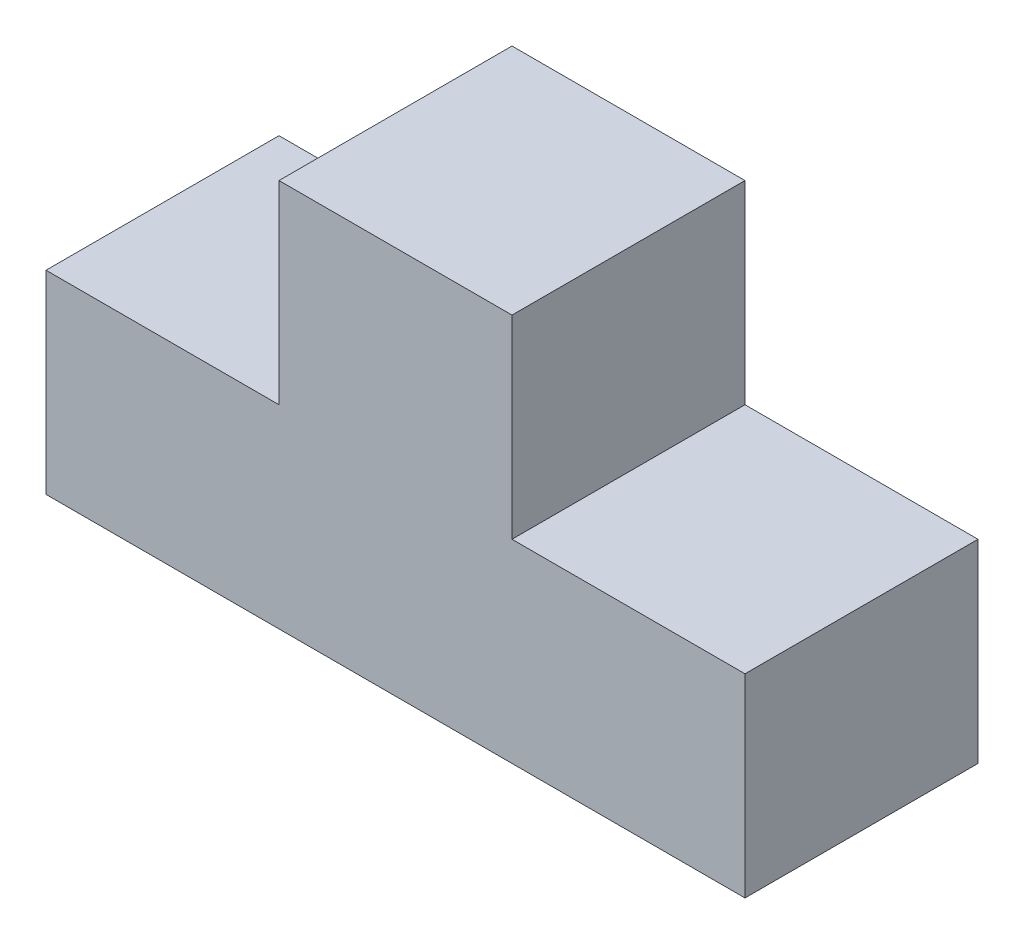
ISO-10303-21;
HEADER;
FILE_DESCRIPTION(('STEP AP214'),'2;1');
FILE_NAME('part.step','',(''),(''),'','','');
FILE_SCHEMA(('AUTOMOTIVE_DESIGN { 1 0 10303 214 1 1 1 1 }'));
ENDSEC;
DATA;
#1=APPLICATION_CONTEXT('core data for automotive mechanical design processes');
#2=APPLICATION_PROTOCOL_DEFINITION('international standard','automotive_design',2000,#1);
#3=PRODUCT_CONTEXT('',#1,'mechanical');
#4=PRODUCT('Part','Part','',(#3));
#5=PRODUCT_RELATED_PRODUCT_CATEGORY('part','',(#4));
#6=PRODUCT_DEFINITION_FORMATION('','',#4);
#7=PRODUCT_DEFINITION_CONTEXT('part definition',#1,'design');
#8=PRODUCT_DEFINITION('design','',#6,#7);
#9=PRODUCT_DEFINITION_SHAPE('','',#8);
#10=(LENGTH_UNIT() NAMED_UNIT(*) SI_UNIT(.MILLI.,.METRE.));
#11=(NAMED_UNIT(*) PLANE_ANGLE_UNIT() SI_UNIT($,.RADIAN.));
#12=(NAMED_UNIT(*) SI_UNIT($,.STERADIAN.) SOLID_ANGLE_UNIT());
#13=UNCERTAINTY_MEASURE_WITH_UNIT(LENGTH_MEASURE(1.E-05),#10,'distance_accuracy_value','');
#14=(GEOMETRIC_REPRESENTATION_CONTEXT(3) GLOBAL_UNCERTAINTY_ASSIGNED_CONTEXT((#13)) GLOBAL_UNIT_ASSIGNED_CONTEXT((#10,
#11,#12)) REPRESENTATION_CONTEXT('',''));
#15=CARTESIAN_POINT('',(0.,0.,0.));
#16=DIRECTION('',(0.,0.,1.));
#17=DIRECTION('',(1.,0.,0.));
#18=AXIS2_PLACEMENT_3D('',#15,#16,#17);
#19=CARTESIAN_POINT('',(45.,25.,30.));
#20=DIRECTION('',(0.,-1.,0.));
#21=DIRECTION('',(1.,0.,0.));
#22=AXIS2_PLACEMENT_3D('',#19,#20,#21);
#23=PLANE('',#22);
#24=DIRECTION('',(-1.,0.,0.));
#25=VECTOR('',#24,1.);
#26=CARTESIAN_POINT('',(45.,25.,0.));
#27=LINE('',#26,#25);
#28=CARTESIAN_POINT('',(45.,25.,0.));
#29=VERTEX_POINT('',#28);
#30=CARTESIAN_POINT('',(15.,25.,0.));
#31=VERTEX_POINT('',#30);
#32=EDGE_CURVE('E131',#29,#31,#27,.T.);
#33=ORIENTED_EDGE('',*,*,#32,.T.);
#34=DIRECTION('',(0.,0.,-1.));
#35=VECTOR('',#34,1.);
#36=CARTESIAN_POINT('',(15.,25.,30.));
#37=LINE('',#36,#35);
#38=CARTESIAN_POINT('',(15.,25.,30.));
#39=VERTEX_POINT('',#38);
#40=EDGE_CURVE('E11',#39,#31,#37,.T.);
#41=ORIENTED_EDGE('',*,*,#40,.F.);
#42=DIRECTION('',(-1.,0.,0.));
#43=VECTOR('',#42,1.);
#44=CARTESIAN_POINT('',(45.,25.,30.));
#45=LINE('',#44,#43);
#46=CARTESIAN_POINT('',(45.,25.,30.));
#47=VERTEX_POINT('',#46);
#48=EDGE_CURVE('E148',#47,#39,#45,.T.);
#49=ORIENTED_EDGE('',*,*,#48,.F.);
#50=DIRECTION('',(0.,0.,-1.));
#51=VECTOR('',#50,1.);
#52=CARTESIAN_POINT('',(45.,25.,30.));
#53=LINE('',#52,#51);
#54=EDGE_CURVE('E130',#47,#29,#53,.T.);
#55=ORIENTED_EDGE('',*,*,#54,.T.);
#56=EDGE_LOOP('',(#33,#41,#49,#55));
#57=FACE_BOUND('',#56,.T.);
#58=ADVANCED_FACE('F33',(#57),#23,.F.);
#59=CARTESIAN_POINT('',(15.,25.,30.));
#60=DIRECTION('',(-1.,0.,0.));
#61=DIRECTION('',(0.,0.,1.));
#62=AXIS2_PLACEMENT_3D('',#59,#60,#61);
#63=PLANE('',#62);
#64=DIRECTION('',(0.,1.,0.));
#65=VECTOR('',#64,1.);
#66=CARTESIAN_POINT('',(15.,25.,0.));
#67=LINE('',#66,#65);
#68=CARTESIAN_POINT('',(15.,50.,0.));
#69=VERTEX_POINT('',#68);
#70=EDGE_CURVE('E134',#31,#69,#67,.T.);
#71=ORIENTED_EDGE('',*,*,#70,.T.);
#72=DIRECTION('',(0.,0.,-1.));
#73=VECTOR('',#72,1.);
#74=CARTESIAN_POINT('',(15.,50.,30.));
#75=LINE('',#74,#73);
#76=CARTESIAN_POINT('',(15.,50.,30.));
#77=VERTEX_POINT('',#76);
#78=EDGE_CURVE('E41',#77,#69,#75,.T.);
#79=ORIENTED_EDGE('',*,*,#78,.F.);
#80=DIRECTION('',(0.,1.,0.));
#81=VECTOR('',#80,1.);
#82=CARTESIAN_POINT('',(15.,25.,30.));
#83=LINE('',#82,#81);
#84=EDGE_CURVE('E91',#39,#77,#83,.T.);
#85=ORIENTED_EDGE('',*,*,#84,.F.);
#86=ORIENTED_EDGE('',*,*,#40,.T.);
#87=EDGE_LOOP('',(#71,#79,#85,#86));
#88=FACE_BOUND('',#87,.T.);
#89=ADVANCED_FACE('F176',(#88),#63,.F.);
#90=CARTESIAN_POINT('',(15.,50.,30.));
#91=DIRECTION('',(0.,-1.,0.));
#92=DIRECTION('',(0.,0.,-1.));
#93=AXIS2_PLACEMENT_3D('',#90,#91,#92);
#94=PLANE('',#93);
#95=DIRECTION('',(-1.,0.,0.));
#96=VECTOR('',#95,1.);
#97=CARTESIAN_POINT('',(15.,50.,0.));
#98=LINE('',#97,#96);
#99=CARTESIAN_POINT('',(-15.,50.,0.));
#100=VERTEX_POINT('',#99);
#101=EDGE_CURVE('E136',#69,#100,#98,.T.);
#102=ORIENTED_EDGE('',*,*,#101,.T.);
#103=DIRECTION('',(0.,0.,-1.));
#104=VECTOR('',#103,1.);
#105=CARTESIAN_POINT('',(-15.,50.,30.));
#106=LINE('',#105,#104);
#107=CARTESIAN_POINT('',(-15.,50.,30.));
#108=VERTEX_POINT('',#107);
#109=EDGE_CURVE('E154',#108,#100,#106,.T.);
#110=ORIENTED_EDGE('',*,*,#109,.F.);
#111=DIRECTION('',(-1.,0.,0.));
#112=VECTOR('',#111,1.);
#113=CARTESIAN_POINT('',(15.,50.,30.));
#114=LINE('',#113,#112);
#115=EDGE_CURVE('E161',#77,#108,#114,.T.);
#116=ORIENTED_EDGE('',*,*,#115,.F.);
#117=ORIENTED_EDGE('',*,*,#78,.T.);
#118=EDGE_LOOP('',(#102,#110,#116,#117));
#119=FACE_BOUND('',#118,.T.);
#120=ADVANCED_FACE('F159',(#119),#94,.F.);
#121=CARTESIAN_POINT('',(-15.,25.,30.));
#122=DIRECTION('',(-1.,0.,0.));
#123=DIRECTION('',(0.,0.,1.));
#124=AXIS2_PLACEMENT_3D('',#121,#122,#123);
#125=PLANE('',#124);
#126=DIRECTION('',(0.,1.,0.));
#127=VECTOR('',#126,1.);
#128=CARTESIAN_POINT('',(-15.,25.,0.));
#129=LINE('',#128,#127);
#130=CARTESIAN_POINT('',(-15.,25.,0.));
#131=VERTEX_POINT('',#130);
#132=EDGE_CURVE('E139',#131,#100,#129,.T.);
#133=ORIENTED_EDGE('',*,*,#132,.F.);
#134=DIRECTION('',(0.,0.,-1.));
#135=VECTOR('',#134,1.);
#136=CARTESIAN_POINT('',(-15.,25.,30.));
#137=LINE('',#136,#135);
#138=CARTESIAN_POINT('',(-15.,25.,30.));
#139=VERTEX_POINT('',#138);
#140=EDGE_CURVE('E152',#139,#131,#137,.T.);
#141=ORIENTED_EDGE('',*,*,#140,.F.);
#142=DIRECTION('',(0.,1.,0.));
#143=VECTOR('',#142,1.);
#144=CARTESIAN_POINT('',(-15.,25.,30.));
#145=LINE('',#144,#143);
#146=EDGE_CURVE('E125',#139,#108,#145,.T.);
#147=ORIENTED_EDGE('',*,*,#146,.T.);
#148=ORIENTED_EDGE('',*,*,#109,.T.);
#149=EDGE_LOOP('',(#133,#141,#147,#148));
#150=FACE_BOUND('',#149,.T.);
#151=ADVANCED_FACE('F168',(#150),#125,.T.);
#152=CARTESIAN_POINT('',(-45.,25.,30.));
#153=DIRECTION('',(0.,1.,0.));
#154=DIRECTION('',(-1.,0.,0.));
#155=AXIS2_PLACEMENT_3D('',#152,#153,#154);
#156=PLANE('',#155);
#157=DIRECTION('',(1.,0.,0.));
#158=VECTOR('',#157,1.);
#159=CARTESIAN_POINT('',(-45.,25.,0.));
#160=LINE('',#159,#158);
#161=CARTESIAN_POINT('',(-45.,25.,0.));
#162=VERTEX_POINT('',#161);
#163=EDGE_CURVE('E142',#162,#131,#160,.T.);
#164=ORIENTED_EDGE('',*,*,#163,.F.);
#165=DIRECTION('',(0.,0.,-1.));
#166=VECTOR('',#165,1.);
#167=CARTESIAN_POINT('',(-45.,25.,30.));
#168=LINE('',#167,#166);
#169=CARTESIAN_POINT('',(-45.,25.,30.));
#170=VERTEX_POINT('',#169);
#171=EDGE_CURVE('E113',#170,#162,#168,.T.);
#172=ORIENTED_EDGE('',*,*,#171,.F.);
#173=DIRECTION('',(1.,0.,0.));
#174=VECTOR('',#173,1.);
#175=CARTESIAN_POINT('',(-45.,25.,30.));
#176=LINE('',#175,#174);
#177=EDGE_CURVE('E123',#170,#139,#176,.T.);
#178=ORIENTED_EDGE('',*,*,#177,.T.);
#179=ORIENTED_EDGE('',*,*,#140,.T.);
#180=EDGE_LOOP('',(#164,#172,#178,#179));
#181=FACE_BOUND('',#180,.T.);
#182=ADVANCED_FACE('F186',(#181),#156,.T.);
#183=CARTESIAN_POINT('',(-45.,0.,30.));
#184=DIRECTION('',(-1.,0.,0.));
#185=DIRECTION('',(0.,0.,1.));
#186=AXIS2_PLACEMENT_3D('',#183,#184,#185);
#187=PLANE('',#186);
#188=DIRECTION('',(0.,1.,0.));
#189=VECTOR('',#188,1.);
#190=CARTESIAN_POINT('',(-45.,0.,0.));
#191=LINE('',#190,#189);
#192=CARTESIAN_POINT('',(-45.,0.,0.));
#193=VERTEX_POINT('',#192);
#194=EDGE_CURVE('E112',#193,#162,#191,.T.);
#195=ORIENTED_EDGE('',*,*,#194,.F.);
#196=DIRECTION('',(0.,0.,-1.));
#197=VECTOR('',#196,1.);
#198=CARTESIAN_POINT('',(-45.,0.,30.));
#199=LINE('',#198,#197);
#200=CARTESIAN_POINT('',(-45.,0.,30.));
#201=VERTEX_POINT('',#200);
#202=EDGE_CURVE('E106',#201,#193,#199,.T.);
#203=ORIENTED_EDGE('',*,*,#202,.F.);
#204=DIRECTION('',(0.,1.,0.));
#205=VECTOR('',#204,1.);
#206=CARTESIAN_POINT('',(-45.,0.,30.));
#207=LINE('',#206,#205);
#208=EDGE_CURVE('E110',#201,#170,#207,.T.);
#209=ORIENTED_EDGE('',*,*,#208,.T.);
#210=ORIENTED_EDGE('',*,*,#171,.T.);
#211=EDGE_LOOP('',(#195,#203,#209,#210));
#212=FACE_BOUND('',#211,.T.);
#213=ADVANCED_FACE('F108',(#212),#187,.T.);
#214=CARTESIAN_POINT('',(-45.,0.,30.));
#215=DIRECTION('',(0.,1.,0.));
#216=DIRECTION('',(0.,0.,1.));
#217=AXIS2_PLACEMENT_3D('',#214,#215,#216);
#218=PLANE('',#217);
#219=DIRECTION('',(1.,0.,0.));
#220=VECTOR('',#219,1.);
#221=CARTESIAN_POINT('',(-45.,0.,0.));
#222=LINE('',#221,#220);
#223=CARTESIAN_POINT('',(45.,0.,0.));
#224=VERTEX_POINT('',#223);
#225=EDGE_CURVE('E77',#193,#224,#222,.T.);
#226=ORIENTED_EDGE('',*,*,#225,.T.);
#227=DIRECTION('',(0.,0.,-1.));
#228=VECTOR('',#227,1.);
#229=CARTESIAN_POINT('',(45.,0.,30.));
#230=LINE('',#229,#228);
#231=CARTESIAN_POINT('',(45.,0.,30.));
#232=VERTEX_POINT('',#231);
#233=EDGE_CURVE('E114',#232,#224,#230,.T.);
#234=ORIENTED_EDGE('',*,*,#233,.F.);
#235=DIRECTION('',(1.,0.,0.));
#236=VECTOR('',#235,1.);
#237=CARTESIAN_POINT('',(-45.,0.,30.));
#238=LINE('',#237,#236);
#239=EDGE_CURVE('E116',#201,#232,#238,.T.);
#240=ORIENTED_EDGE('',*,*,#239,.F.);
#241=ORIENTED_EDGE('',*,*,#202,.T.);
#242=EDGE_LOOP('',(#226,#234,#240,#241));
#243=FACE_BOUND('',#242,.T.);
#244=ADVANCED_FACE('F117',(#243),#218,.F.);
#245=CARTESIAN_POINT('',(45.,0.,30.));
#246=DIRECTION('',(-1.,0.,0.));
#247=DIRECTION('',(0.,0.,1.));
#248=AXIS2_PLACEMENT_3D('',#245,#246,#247);
#249=PLANE('',#248);
#250=DIRECTION('',(0.,1.,0.));
#251=VECTOR('',#250,1.);
#252=CARTESIAN_POINT('',(45.,0.,0.));
#253=LINE('',#252,#251);
#254=EDGE_CURVE('E83',#224,#29,#253,.T.);
#255=ORIENTED_EDGE('',*,*,#254,.T.);
#256=ORIENTED_EDGE('',*,*,#54,.F.);
#257=DIRECTION('',(0.,1.,0.));
#258=VECTOR('',#257,1.);
#259=CARTESIAN_POINT('',(45.,0.,30.));
#260=LINE('',#259,#258);
#261=EDGE_CURVE('E49',#232,#47,#260,.T.);
#262=ORIENTED_EDGE('',*,*,#261,.F.);
#263=ORIENTED_EDGE('',*,*,#233,.T.);
#264=EDGE_LOOP('',(#255,#256,#262,#263));
#265=FACE_BOUND('',#264,.T.);
#266=ADVANCED_FACE('F194',(#265),#249,.F.);
#267=CARTESIAN_POINT('',(0.,0.,30.));
#268=DIRECTION('',(0.,0.,-1.));
#269=DIRECTION('',(-1.,0.,0.));
#270=AXIS2_PLACEMENT_3D('',#267,#268,#269);
#271=PLANE('',#270);
#272=ORIENTED_EDGE('',*,*,#48,.T.);
#273=ORIENTED_EDGE('',*,*,#84,.T.);
#274=ORIENTED_EDGE('',*,*,#115,.T.);
#275=ORIENTED_EDGE('',*,*,#146,.F.);
#276=ORIENTED_EDGE('',*,*,#177,.F.);
#277=ORIENTED_EDGE('',*,*,#208,.F.);
#278=ORIENTED_EDGE('',*,*,#239,.T.);
#279=ORIENTED_EDGE('',*,*,#261,.T.);
#280=EDGE_LOOP('',(#272,#273,#274,#275,#276,#277,#278,#279));
#281=FACE_BOUND('',#280,.T.);
#282=ADVANCED_FACE('F120',(#281),#271,.F.);
#283=CARTESIAN_POINT('',(0.,0.,0.));
#284=DIRECTION('',(0.,0.,-1.));
#285=DIRECTION('',(-1.,0.,0.));
#286=AXIS2_PLACEMENT_3D('',#283,#284,#285);
#287=PLANE('',#286);
#288=ORIENTED_EDGE('',*,*,#32,.F.);
#289=ORIENTED_EDGE('',*,*,#254,.F.);
#290=ORIENTED_EDGE('',*,*,#225,.F.);
#291=ORIENTED_EDGE('',*,*,#194,.T.);
#292=ORIENTED_EDGE('',*,*,#163,.T.);
#293=ORIENTED_EDGE('',*,*,#132,.T.);
#294=ORIENTED_EDGE('',*,*,#101,.F.);
#295=ORIENTED_EDGE('',*,*,#70,.F.);
#296=EDGE_LOOP('',(#288,#289,#290,#291,#292,#293,#294,#295));
#297=FACE_BOUND('',#296,.T.);
#298=ADVANCED_FACE('F164',(#297),#287,.T.);
#299=CLOSED_SHELL('',(#58,#89,#120,#151,#182,#213,#244,#266,#282,#298));
#300=MANIFOLD_SOLID_BREP('B2',#299);
#301=ADVANCED_BREP_SHAPE_REPRESENTATION('',(#18,#300),#14);
#302=SHAPE_DEFINITION_REPRESENTATION(#9,#301);
ENDSEC;
END-ISO-10303-21;
